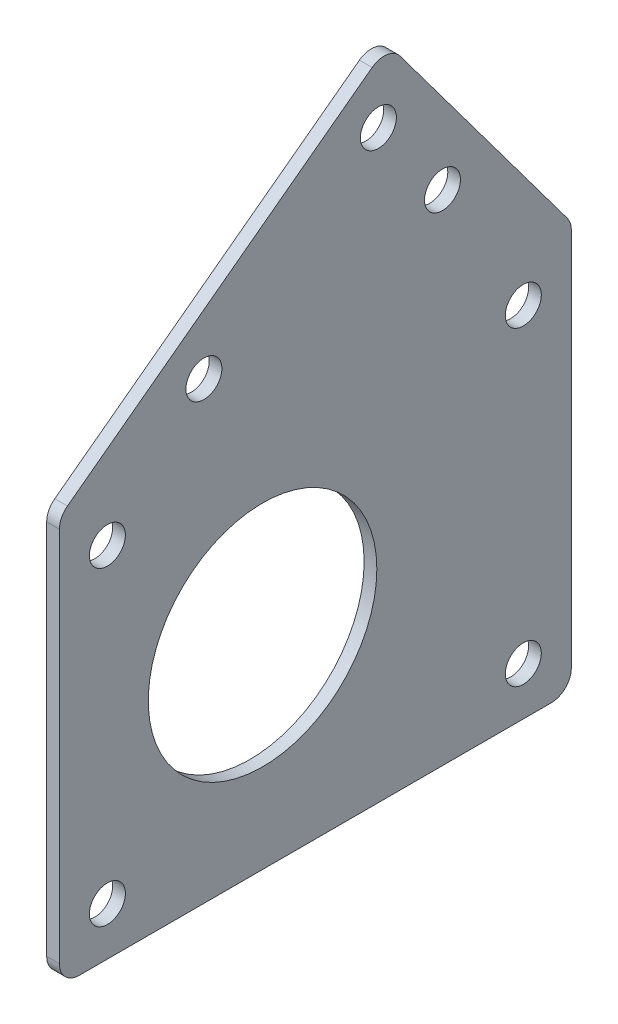
ISO-10303-21;
HEADER;
FILE_DESCRIPTION(('STEP AP214'),'2;1');
FILE_NAME('part.step','',(''),(''),'','','');
FILE_SCHEMA(('AUTOMOTIVE_DESIGN { 1 0 10303 214 1 1 1 1 }'));
ENDSEC;
DATA;
#1=APPLICATION_CONTEXT('core data for automotive mechanical design processes');
#2=APPLICATION_PROTOCOL_DEFINITION('international standard','automotive_design',2000,#1);
#3=PRODUCT_CONTEXT('',#1,'mechanical');
#4=PRODUCT('Part','Part','',(#3));
#5=PRODUCT_RELATED_PRODUCT_CATEGORY('part','',(#4));
#6=PRODUCT_DEFINITION_FORMATION('','',#4);
#7=PRODUCT_DEFINITION_CONTEXT('part definition',#1,'design');
#8=PRODUCT_DEFINITION('design','',#6,#7);
#9=PRODUCT_DEFINITION_SHAPE('','',#8);
#10=(LENGTH_UNIT() NAMED_UNIT(*) SI_UNIT(.MILLI.,.METRE.));
#11=(NAMED_UNIT(*) PLANE_ANGLE_UNIT() SI_UNIT($,.RADIAN.));
#12=(NAMED_UNIT(*) SI_UNIT($,.STERADIAN.) SOLID_ANGLE_UNIT());
#13=UNCERTAINTY_MEASURE_WITH_UNIT(LENGTH_MEASURE(1.E-05),#10,'distance_accuracy_value','');
#14=(GEOMETRIC_REPRESENTATION_CONTEXT(3) GLOBAL_UNCERTAINTY_ASSIGNED_CONTEXT((#13)) GLOBAL_UNIT_ASSIGNED_CONTEXT((#10,
#11,#12)) REPRESENTATION_CONTEXT('',''));
#15=CARTESIAN_POINT('',(0.,0.,0.));
#16=DIRECTION('',(0.,0.,1.));
#17=DIRECTION('',(1.,0.,0.));
#18=AXIS2_PLACEMENT_3D('',#15,#16,#17);
#19=CARTESIAN_POINT('',(103.1875,24.5697881383849,-36.1));
#20=DIRECTION('',(-1.,0.,0.));
#21=DIRECTION('',(0.,0.,1.));
#22=AXIS2_PLACEMENT_3D('',#19,#20,#21);
#23=CYLINDRICAL_SURFACE('',#22,2.5);
#24=CARTESIAN_POINT('',(101.6,24.5697881383849,-36.1));
#25=DIRECTION('',(1.,0.,0.));
#26=DIRECTION('',(0.,0.,-1.));
#27=AXIS2_PLACEMENT_3D('',#24,#25,#26);
#28=CIRCLE('',#27,2.5);
#29=CARTESIAN_POINT('',(101.6,26.0652877493296,-38.1033673935812));
#30=VERTEX_POINT('',#29);
#31=CARTESIAN_POINT('',(101.6,24.5697881383849,-38.6));
#32=VERTEX_POINT('',#31);
#33=EDGE_CURVE('E171',#30,#32,#28,.F.);
#34=ORIENTED_EDGE('',*,*,#33,.F.);
#35=DIRECTION('',(-1.,0.,0.));
#36=VECTOR('',#35,1.);
#37=CARTESIAN_POINT('',(103.1875,26.0652877493296,-38.1033673935812));
#38=LINE('',#37,#36);
#39=CARTESIAN_POINT('',(103.1875,26.0652877493296,-38.1033673935812));
#40=VERTEX_POINT('',#39);
#41=EDGE_CURVE('E11',#40,#30,#38,.T.);
#42=ORIENTED_EDGE('',*,*,#41,.F.);
#43=CARTESIAN_POINT('',(103.1875,24.5697881383849,-36.1));
#44=DIRECTION('',(1.,0.,0.));
#45=DIRECTION('',(0.,0.,-1.));
#46=AXIS2_PLACEMENT_3D('',#43,#44,#45);
#47=CIRCLE('',#46,2.5);
#48=CARTESIAN_POINT('',(103.1875,24.5697881383849,-38.6));
#49=VERTEX_POINT('',#48);
#50=EDGE_CURVE('E218',#40,#49,#47,.F.);
#51=ORIENTED_EDGE('',*,*,#50,.T.);
#52=DIRECTION('',(-1.,0.,0.));
#53=VECTOR('',#52,1.);
#54=CARTESIAN_POINT('',(103.1875,24.5697881383849,-38.6));
#55=LINE('',#54,#53);
#56=EDGE_CURVE('E57',#49,#32,#55,.T.);
#57=ORIENTED_EDGE('',*,*,#56,.T.);
#58=EDGE_LOOP('',(#34,#42,#51,#57));
#59=FACE_BOUND('',#58,.T.);
#60=ADVANCED_FACE('F41',(#59),#23,.T.);
#61=CARTESIAN_POINT('',(103.1875,27.5927267006994,-36.9631450036021));
#62=DIRECTION('',(0.,0.598199844377869,-0.80134695743248));
#63=DIRECTION('',(0.,0.80134695743248,0.598199844377869));
#64=AXIS2_PLACEMENT_3D('',#61,#62,#63);
#65=PLANE('',#64);
#66=DIRECTION('',(0.,-0.80134695743248,-0.598199844377869));
#67=VECTOR('',#66,1.);
#68=CARTESIAN_POINT('',(101.6,27.5927267006994,-36.9631450036021));
#69=LINE('',#68,#67);
#70=CARTESIAN_POINT('',(101.6,54.0760326210612,-17.1935441668675));
#71=VERTEX_POINT('',#70);
#72=EDGE_CURVE('E173',#71,#30,#69,.T.);
#73=ORIENTED_EDGE('',*,*,#72,.F.);
#74=DIRECTION('',(-1.,0.,0.));
#75=VECTOR('',#74,1.);
#76=CARTESIAN_POINT('',(103.1875,54.0760326210612,-17.1935441668675));
#77=LINE('',#76,#75);
#78=CARTESIAN_POINT('',(103.1875,54.0760326210612,-17.1935441668675));
#79=VERTEX_POINT('',#78);
#80=EDGE_CURVE('E49',#79,#71,#77,.T.);
#81=ORIENTED_EDGE('',*,*,#80,.F.);
#82=DIRECTION('',(0.,-0.80134695743248,-0.598199844377869));
#83=VECTOR('',#82,1.);
#84=CARTESIAN_POINT('',(103.1875,27.5927267006994,-36.9631450036021));
#85=LINE('',#84,#83);
#86=EDGE_CURVE('E254',#79,#40,#85,.T.);
#87=ORIENTED_EDGE('',*,*,#86,.T.);
#88=ORIENTED_EDGE('',*,*,#41,.T.);
#89=EDGE_LOOP('',(#73,#81,#87,#88));
#90=FACE_BOUND('',#89,.T.);
#91=ADVANCED_FACE('F241',(#90),#65,.T.);
#92=CARTESIAN_POINT('',(103.1875,52.5805330101165,-15.1901767732863));
#93=DIRECTION('',(-1.,0.,0.));
#94=DIRECTION('',(0.,0.,1.));
#95=AXIS2_PLACEMENT_3D('',#92,#93,#94);
#96=CYLINDRICAL_SURFACE('',#95,2.5);
#97=CARTESIAN_POINT('',(101.6,52.5805330101165,-15.1901767732863));
#98=DIRECTION('',(1.,0.,0.));
#99=DIRECTION('',(0.,0.,-1.));
#100=AXIS2_PLACEMENT_3D('',#97,#98,#99);
#101=CIRCLE('',#100,2.5);
#102=CARTESIAN_POINT('',(101.6,54.5839004036977,-13.6946771623416));
#103=VERTEX_POINT('',#102);
#104=EDGE_CURVE('E176',#103,#71,#101,.F.);
#105=ORIENTED_EDGE('',*,*,#104,.F.);
#106=DIRECTION('',(-1.,0.,0.));
#107=VECTOR('',#106,1.);
#108=CARTESIAN_POINT('',(103.1875,54.5839004036977,-13.6946771623416));
#109=LINE('',#108,#107);
#110=CARTESIAN_POINT('',(103.1875,54.5839004036977,-13.6946771623416));
#111=VERTEX_POINT('',#110);
#112=EDGE_CURVE('E230',#111,#103,#109,.T.);
#113=ORIENTED_EDGE('',*,*,#112,.F.);
#114=CARTESIAN_POINT('',(103.1875,52.5805330101165,-15.1901767732863));
#115=DIRECTION('',(1.,0.,0.));
#116=DIRECTION('',(0.,0.,-1.));
#117=AXIS2_PLACEMENT_3D('',#114,#115,#116);
#118=CIRCLE('',#117,2.5);
#119=EDGE_CURVE('E237',#111,#79,#118,.F.);
#120=ORIENTED_EDGE('',*,*,#119,.T.);
#121=ORIENTED_EDGE('',*,*,#80,.T.);
#122=EDGE_LOOP('',(#105,#113,#120,#121));
#123=FACE_BOUND('',#122,.T.);
#124=ADVANCED_FACE('F235',(#123),#96,.T.);
#125=CARTESIAN_POINT('',(103.1875,28.4866733139431,21.2651004476793));
#126=DIRECTION('',(0.,0.801346957432481,0.598199844377868));
#127=DIRECTION('',(0.,-0.598199844377868,0.801346957432481));
#128=AXIS2_PLACEMENT_3D('',#125,#126,#127);
#129=PLANE('',#128);
#130=DIRECTION('',(0.,0.598199844377868,-0.801346957432481));
#131=VECTOR('',#130,1.);
#132=CARTESIAN_POINT('',(101.6,28.4866733139431,21.2651004476793));
#133=LINE('',#132,#131);
#134=CARTESIAN_POINT('',(101.6,26.1498524463557,24.3954996109447));
#135=VERTEX_POINT('',#134);
#136=EDGE_CURVE('E179',#135,#103,#133,.T.);
#137=ORIENTED_EDGE('',*,*,#136,.F.);
#138=DIRECTION('',(-1.,0.,0.));
#139=VECTOR('',#138,1.);
#140=CARTESIAN_POINT('',(103.1875,26.1498524463557,24.3954996109447));
#141=LINE('',#140,#139);
#142=CARTESIAN_POINT('',(103.1875,26.1498524463557,24.3954996109447));
#143=VERTEX_POINT('',#142);
#144=EDGE_CURVE('E228',#143,#135,#141,.T.);
#145=ORIENTED_EDGE('',*,*,#144,.F.);
#146=DIRECTION('',(0.,0.598199844377868,-0.801346957432481));
#147=VECTOR('',#146,1.);
#148=CARTESIAN_POINT('',(103.1875,28.4866733139431,21.2651004476793));
#149=LINE('',#148,#147);
#150=EDGE_CURVE('E253',#143,#111,#149,.T.);
#151=ORIENTED_EDGE('',*,*,#150,.T.);
#152=ORIENTED_EDGE('',*,*,#112,.T.);
#153=EDGE_LOOP('',(#137,#145,#151,#152));
#154=FACE_BOUND('',#153,.T.);
#155=ADVANCED_FACE('F249',(#154),#129,.T.);
#156=CARTESIAN_POINT('',(103.1875,24.1464850527745,22.9));
#157=DIRECTION('',(-1.,0.,0.));
#158=DIRECTION('',(0.,0.,1.));
#159=AXIS2_PLACEMENT_3D('',#156,#157,#158);
#160=CYLINDRICAL_SURFACE('',#159,2.5);
#161=CARTESIAN_POINT('',(101.6,24.1464850527745,22.9));
#162=DIRECTION('',(1.,0.,0.));
#163=DIRECTION('',(0.,0.,-1.));
#164=AXIS2_PLACEMENT_3D('',#161,#162,#163);
#165=CIRCLE('',#164,2.5);
#166=CARTESIAN_POINT('',(101.6,24.1464850527744,25.4));
#167=VERTEX_POINT('',#166);
#168=EDGE_CURVE('E182',#135,#167,#165,.T.);
#169=ORIENTED_EDGE('',*,*,#168,.T.);
#170=DIRECTION('',(-1.,0.,0.));
#171=VECTOR('',#170,1.);
#172=CARTESIAN_POINT('',(103.1875,24.1464850527744,25.4));
#173=LINE('',#172,#171);
#174=CARTESIAN_POINT('',(103.1875,24.1464850527744,25.4));
#175=VERTEX_POINT('',#174);
#176=EDGE_CURVE('E225',#175,#167,#173,.T.);
#177=ORIENTED_EDGE('',*,*,#176,.F.);
#178=CARTESIAN_POINT('',(103.1875,24.1464850527745,22.9));
#179=DIRECTION('',(1.,0.,0.));
#180=DIRECTION('',(0.,0.,-1.));
#181=AXIS2_PLACEMENT_3D('',#178,#179,#180);
#182=CIRCLE('',#181,2.5);
#183=EDGE_CURVE('E256',#143,#175,#182,.T.);
#184=ORIENTED_EDGE('',*,*,#183,.F.);
#185=ORIENTED_EDGE('',*,*,#144,.T.);
#186=EDGE_LOOP('',(#169,#177,#184,#185));
#187=FACE_BOUND('',#186,.T.);
#188=ADVANCED_FACE('F297',(#187),#160,.T.);
#189=CARTESIAN_POINT('',(103.1875,0.,25.4));
#190=DIRECTION('',(0.,0.,-1.));
#191=DIRECTION('',(0.,1.,0.));
#192=AXIS2_PLACEMENT_3D('',#189,#190,#191);
#193=PLANE('',#192);
#194=DIRECTION('',(0.,-1.,0.));
#195=VECTOR('',#194,1.);
#196=CARTESIAN_POINT('',(101.6,0.,25.4));
#197=LINE('',#196,#195);
#198=CARTESIAN_POINT('',(101.6,-22.9,25.4));
#199=VERTEX_POINT('',#198);
#200=EDGE_CURVE('E184',#167,#199,#197,.T.);
#201=ORIENTED_EDGE('',*,*,#200,.T.);
#202=DIRECTION('',(-1.,0.,0.));
#203=VECTOR('',#202,1.);
#204=CARTESIAN_POINT('',(103.1875,-22.9,25.4));
#205=LINE('',#204,#203);
#206=CARTESIAN_POINT('',(103.1875,-22.9,25.4));
#207=VERTEX_POINT('',#206);
#208=EDGE_CURVE('E222',#207,#199,#205,.T.);
#209=ORIENTED_EDGE('',*,*,#208,.F.);
#210=DIRECTION('',(0.,-1.,0.));
#211=VECTOR('',#210,1.);
#212=CARTESIAN_POINT('',(103.1875,0.,25.4));
#213=LINE('',#212,#211);
#214=EDGE_CURVE('E262',#175,#207,#213,.T.);
#215=ORIENTED_EDGE('',*,*,#214,.F.);
#216=ORIENTED_EDGE('',*,*,#176,.T.);
#217=EDGE_LOOP('',(#201,#209,#215,#216));
#218=FACE_BOUND('',#217,.T.);
#219=ADVANCED_FACE('F267',(#218),#193,.F.);
#220=CARTESIAN_POINT('',(103.1875,-22.9,22.9));
#221=DIRECTION('',(-1.,0.,0.));
#222=DIRECTION('',(0.,0.,1.));
#223=AXIS2_PLACEMENT_3D('',#220,#221,#222);
#224=CYLINDRICAL_SURFACE('',#223,2.5);
#225=CARTESIAN_POINT('',(101.6,-22.9,22.9));
#226=DIRECTION('',(1.,0.,0.));
#227=DIRECTION('',(0.,0.,-1.));
#228=AXIS2_PLACEMENT_3D('',#225,#226,#227);
#229=CIRCLE('',#228,2.5);
#230=CARTESIAN_POINT('',(101.6,-25.4,22.9));
#231=VERTEX_POINT('',#230);
#232=EDGE_CURVE('E186',#199,#231,#229,.T.);
#233=ORIENTED_EDGE('',*,*,#232,.T.);
#234=DIRECTION('',(-1.,0.,0.));
#235=VECTOR('',#234,1.);
#236=CARTESIAN_POINT('',(103.1875,-25.4,22.9));
#237=LINE('',#236,#235);
#238=CARTESIAN_POINT('',(103.1875,-25.4,22.9));
#239=VERTEX_POINT('',#238);
#240=EDGE_CURVE('E139',#239,#231,#237,.T.);
#241=ORIENTED_EDGE('',*,*,#240,.F.);
#242=CARTESIAN_POINT('',(103.1875,-22.9,22.9));
#243=DIRECTION('',(1.,0.,0.));
#244=DIRECTION('',(0.,0.,-1.));
#245=AXIS2_PLACEMENT_3D('',#242,#243,#244);
#246=CIRCLE('',#245,2.5);
#247=EDGE_CURVE('E127',#207,#239,#246,.T.);
#248=ORIENTED_EDGE('',*,*,#247,.F.);
#249=ORIENTED_EDGE('',*,*,#208,.T.);
#250=EDGE_LOOP('',(#233,#241,#248,#249));
#251=FACE_BOUND('',#250,.T.);
#252=ADVANCED_FACE('F270',(#251),#224,.T.);
#253=CARTESIAN_POINT('',(103.1875,-25.4,0.));
#254=DIRECTION('',(0.,1.,0.));
#255=DIRECTION('',(0.,0.,1.));
#256=AXIS2_PLACEMENT_3D('',#253,#254,#255);
#257=PLANE('',#256);
#258=DIRECTION('',(0.,0.,-1.));
#259=VECTOR('',#258,1.);
#260=CARTESIAN_POINT('',(101.6,-25.4,0.));
#261=LINE('',#260,#259);
#262=CARTESIAN_POINT('',(101.6,-25.4,-36.1));
#263=VERTEX_POINT('',#262);
#264=EDGE_CURVE('E136',#231,#263,#261,.T.);
#265=ORIENTED_EDGE('',*,*,#264,.T.);
#266=DIRECTION('',(-1.,0.,0.));
#267=VECTOR('',#266,1.);
#268=CARTESIAN_POINT('',(103.1875,-25.4,-36.1));
#269=LINE('',#268,#267);
#270=CARTESIAN_POINT('',(103.1875,-25.4,-36.1));
#271=VERTEX_POINT('',#270);
#272=EDGE_CURVE('E133',#271,#263,#269,.T.);
#273=ORIENTED_EDGE('',*,*,#272,.F.);
#274=DIRECTION('',(0.,0.,-1.));
#275=VECTOR('',#274,1.);
#276=CARTESIAN_POINT('',(103.1875,-25.4,0.));
#277=LINE('',#276,#275);
#278=EDGE_CURVE('E119',#239,#271,#277,.T.);
#279=ORIENTED_EDGE('',*,*,#278,.F.);
#280=ORIENTED_EDGE('',*,*,#240,.T.);
#281=EDGE_LOOP('',(#265,#273,#279,#280));
#282=FACE_BOUND('',#281,.T.);
#283=ADVANCED_FACE('F134',(#282),#257,.F.);
#284=CARTESIAN_POINT('',(103.1875,-22.9,-36.1));
#285=DIRECTION('',(-1.,0.,0.));
#286=DIRECTION('',(0.,0.,1.));
#287=AXIS2_PLACEMENT_3D('',#284,#285,#286);
#288=CYLINDRICAL_SURFACE('',#287,2.5);
#289=CARTESIAN_POINT('',(101.6,-22.9,-36.1));
#290=DIRECTION('',(1.,0.,0.));
#291=DIRECTION('',(0.,0.,-1.));
#292=AXIS2_PLACEMENT_3D('',#289,#290,#291);
#293=CIRCLE('',#292,2.5);
#294=CARTESIAN_POINT('',(101.6,-22.9,-38.6));
#295=VERTEX_POINT('',#294);
#296=EDGE_CURVE('E189',#263,#295,#293,.T.);
#297=ORIENTED_EDGE('',*,*,#296,.T.);
#298=DIRECTION('',(-1.,0.,0.));
#299=VECTOR('',#298,1.);
#300=CARTESIAN_POINT('',(103.1875,-22.9,-38.6));
#301=LINE('',#300,#299);
#302=CARTESIAN_POINT('',(103.1875,-22.9,-38.6));
#303=VERTEX_POINT('',#302);
#304=EDGE_CURVE('E89',#303,#295,#301,.T.);
#305=ORIENTED_EDGE('',*,*,#304,.F.);
#306=CARTESIAN_POINT('',(103.1875,-22.9,-36.1));
#307=DIRECTION('',(1.,0.,0.));
#308=DIRECTION('',(0.,0.,-1.));
#309=AXIS2_PLACEMENT_3D('',#306,#307,#308);
#310=CIRCLE('',#309,2.5);
#311=EDGE_CURVE('E125',#271,#303,#310,.T.);
#312=ORIENTED_EDGE('',*,*,#311,.F.);
#313=ORIENTED_EDGE('',*,*,#272,.T.);
#314=EDGE_LOOP('',(#297,#305,#312,#313));
#315=FACE_BOUND('',#314,.T.);
#316=ADVANCED_FACE('F141',(#315),#288,.T.);
#317=CARTESIAN_POINT('',(103.1875,36.9440699741851,-22.4950397922586));
#318=DIRECTION('',(-1.,0.,0.));
#319=DIRECTION('',(0.,0.,1.));
#320=AXIS2_PLACEMENT_3D('',#317,#318,#319);
#321=CYLINDRICAL_SURFACE('',#320,2.25);
#322=CARTESIAN_POINT('',(103.1875,36.9440699741851,-22.4950397922586));
#323=DIRECTION('',(1.,0.,0.));
#324=DIRECTION('',(0.,0.,-1.));
#325=AXIS2_PLACEMENT_3D('',#322,#323,#324);
#326=CIRCLE('',#325,2.25);
#327=CARTESIAN_POINT('',(103.1875,36.9440699741851,-24.7450397922586));
#328=VERTEX_POINT('',#327);
#329=EDGE_CURVE('E165',#328,#328,#326,.T.);
#330=ORIENTED_EDGE('',*,*,#329,.T.);
#331=EDGE_LOOP('',(#330));
#332=FACE_BOUND('',#331,.T.);
#333=CARTESIAN_POINT('',(101.6,36.9440699741851,-22.4950397922586));
#334=DIRECTION('',(1.,0.,0.));
#335=DIRECTION('',(0.,0.,-1.));
#336=AXIS2_PLACEMENT_3D('',#333,#334,#335);
#337=CIRCLE('',#336,2.25);
#338=CARTESIAN_POINT('',(101.6,36.9440699741851,-24.7450397922586));
#339=VERTEX_POINT('',#338);
#340=EDGE_CURVE('E212',#339,#339,#337,.T.);
#341=ORIENTED_EDGE('',*,*,#340,.F.);
#342=EDGE_LOOP('',(#341));
#343=FACE_BOUND('',#342,.T.);
#344=ADVANCED_FACE('F307',(#332,#343),#321,.F.);
#345=CARTESIAN_POINT('',(103.1875,31.4,7.33232270758054));
#346=DIRECTION('',(-1.,0.,0.));
#347=DIRECTION('',(0.,0.,1.));
#348=AXIS2_PLACEMENT_3D('',#345,#346,#347);
#349=CYLINDRICAL_SURFACE('',#348,2.25);
#350=CARTESIAN_POINT('',(103.1875,31.4,7.33232270758054));
#351=DIRECTION('',(1.,0.,0.));
#352=DIRECTION('',(0.,0.,-1.));
#353=AXIS2_PLACEMENT_3D('',#350,#351,#352);
#354=CIRCLE('',#353,2.25);
#355=CARTESIAN_POINT('',(103.1875,31.4,5.08232270758054));
#356=VERTEX_POINT('',#355);
#357=EDGE_CURVE('E162',#356,#356,#354,.T.);
#358=ORIENTED_EDGE('',*,*,#357,.T.);
#359=EDGE_LOOP('',(#358));
#360=FACE_BOUND('',#359,.T.);
#361=CARTESIAN_POINT('',(101.6,31.4,7.33232270758054));
#362=DIRECTION('',(1.,0.,0.));
#363=DIRECTION('',(0.,0.,-1.));
#364=AXIS2_PLACEMENT_3D('',#361,#362,#363);
#365=CIRCLE('',#364,2.25);
#366=CARTESIAN_POINT('',(101.6,31.4,5.08232270758054));
#367=VERTEX_POINT('',#366);
#368=EDGE_CURVE('E209',#367,#367,#365,.T.);
#369=ORIENTED_EDGE('',*,*,#368,.F.);
#370=EDGE_LOOP('',(#369));
#371=FACE_BOUND('',#370,.T.);
#372=ADVANCED_FACE('F311',(#360,#371),#349,.F.);
#373=CARTESIAN_POINT('',(103.1875,-19.4,-32.6));
#374=DIRECTION('',(-1.,0.,0.));
#375=DIRECTION('',(0.,0.,1.));
#376=AXIS2_PLACEMENT_3D('',#373,#374,#375);
#377=CYLINDRICAL_SURFACE('',#376,2.25);
#378=CARTESIAN_POINT('',(103.1875,-19.4,-32.6));
#379=DIRECTION('',(1.,0.,0.));
#380=DIRECTION('',(0.,0.,-1.));
#381=AXIS2_PLACEMENT_3D('',#378,#379,#380);
#382=CIRCLE('',#381,2.25);
#383=CARTESIAN_POINT('',(103.1875,-19.4,-34.85));
#384=VERTEX_POINT('',#383);
#385=EDGE_CURVE('E159',#384,#384,#382,.T.);
#386=ORIENTED_EDGE('',*,*,#385,.T.);
#387=EDGE_LOOP('',(#386));
#388=FACE_BOUND('',#387,.T.);
#389=CARTESIAN_POINT('',(101.6,-19.4,-32.6));
#390=DIRECTION('',(1.,0.,0.));
#391=DIRECTION('',(0.,0.,-1.));
#392=AXIS2_PLACEMENT_3D('',#389,#390,#391);
#393=CIRCLE('',#392,2.25);
#394=CARTESIAN_POINT('',(101.6,-19.4,-34.85));
#395=VERTEX_POINT('',#394);
#396=EDGE_CURVE('E206',#395,#395,#393,.T.);
#397=ORIENTED_EDGE('',*,*,#396,.F.);
#398=EDGE_LOOP('',(#397));
#399=FACE_BOUND('',#398,.T.);
#400=ADVANCED_FACE('F317',(#388,#399),#377,.F.);
#401=CARTESIAN_POINT('',(103.1875,19.4,-32.6));
#402=DIRECTION('',(-1.,0.,0.));
#403=DIRECTION('',(0.,0.,1.));
#404=AXIS2_PLACEMENT_3D('',#401,#402,#403);
#405=CYLINDRICAL_SURFACE('',#404,2.25);
#406=CARTESIAN_POINT('',(103.1875,19.4,-32.6));
#407=DIRECTION('',(1.,0.,0.));
#408=DIRECTION('',(0.,0.,-1.));
#409=AXIS2_PLACEMENT_3D('',#406,#407,#408);
#410=CIRCLE('',#409,2.25);
#411=CARTESIAN_POINT('',(103.1875,19.4,-34.85));
#412=VERTEX_POINT('',#411);
#413=EDGE_CURVE('E156',#412,#412,#410,.T.);
#414=ORIENTED_EDGE('',*,*,#413,.T.);
#415=EDGE_LOOP('',(#414));
#416=FACE_BOUND('',#415,.T.);
#417=CARTESIAN_POINT('',(101.6,19.4,-32.6));
#418=DIRECTION('',(1.,0.,0.));
#419=DIRECTION('',(0.,0.,-1.));
#420=AXIS2_PLACEMENT_3D('',#417,#418,#419);
#421=CIRCLE('',#420,2.25);
#422=CARTESIAN_POINT('',(101.6,19.4,-34.85));
#423=VERTEX_POINT('',#422);
#424=EDGE_CURVE('E203',#423,#423,#421,.T.);
#425=ORIENTED_EDGE('',*,*,#424,.F.);
#426=EDGE_LOOP('',(#425));
#427=FACE_BOUND('',#426,.T.);
#428=ADVANCED_FACE('F325',(#416,#427),#405,.F.);
#429=CARTESIAN_POINT('',(103.1875,-19.4,19.4));
#430=DIRECTION('',(-1.,0.,0.));
#431=DIRECTION('',(0.,0.,1.));
#432=AXIS2_PLACEMENT_3D('',#429,#430,#431);
#433=CYLINDRICAL_SURFACE('',#432,2.25);
#434=CARTESIAN_POINT('',(103.1875,-19.4,19.4));
#435=DIRECTION('',(1.,0.,0.));
#436=DIRECTION('',(0.,0.,-1.));
#437=AXIS2_PLACEMENT_3D('',#434,#435,#436);
#438=CIRCLE('',#437,2.25);
#439=CARTESIAN_POINT('',(103.1875,-19.4,17.15));
#440=VERTEX_POINT('',#439);
#441=EDGE_CURVE('E153',#440,#440,#438,.T.);
#442=ORIENTED_EDGE('',*,*,#441,.T.);
#443=EDGE_LOOP('',(#442));
#444=FACE_BOUND('',#443,.T.);
#445=CARTESIAN_POINT('',(101.6,-19.4,19.4));
#446=DIRECTION('',(1.,0.,0.));
#447=DIRECTION('',(0.,0.,-1.));
#448=AXIS2_PLACEMENT_3D('',#445,#446,#447);
#449=CIRCLE('',#448,2.25);
#450=CARTESIAN_POINT('',(101.6,-19.4,17.15));
#451=VERTEX_POINT('',#450);
#452=EDGE_CURVE('E200',#451,#451,#449,.T.);
#453=ORIENTED_EDGE('',*,*,#452,.F.);
#454=EDGE_LOOP('',(#453));
#455=FACE_BOUND('',#454,.T.);
#456=ADVANCED_FACE('F329',(#444,#455),#433,.F.);
#457=CARTESIAN_POINT('',(103.1875,19.4,19.4));
#458=DIRECTION('',(-1.,0.,0.));
#459=DIRECTION('',(0.,0.,1.));
#460=AXIS2_PLACEMENT_3D('',#457,#458,#459);
#461=CYLINDRICAL_SURFACE('',#460,2.25);
#462=CARTESIAN_POINT('',(103.1875,19.4,19.4));
#463=DIRECTION('',(1.,0.,0.));
#464=DIRECTION('',(0.,0.,-1.));
#465=AXIS2_PLACEMENT_3D('',#462,#463,#464);
#466=CIRCLE('',#465,2.25);
#467=CARTESIAN_POINT('',(103.1875,19.4,17.15));
#468=VERTEX_POINT('',#467);
#469=EDGE_CURVE('E150',#468,#468,#466,.T.);
#470=ORIENTED_EDGE('',*,*,#469,.T.);
#471=EDGE_LOOP('',(#470));
#472=FACE_BOUND('',#471,.T.);
#473=CARTESIAN_POINT('',(101.6,19.4,19.4));
#474=DIRECTION('',(1.,0.,0.));
#475=DIRECTION('',(0.,0.,-1.));
#476=AXIS2_PLACEMENT_3D('',#473,#474,#475);
#477=CIRCLE('',#476,2.25);
#478=CARTESIAN_POINT('',(101.6,19.4,17.15));
#479=VERTEX_POINT('',#478);
#480=EDGE_CURVE('E197',#479,#479,#477,.T.);
#481=ORIENTED_EDGE('',*,*,#480,.F.);
#482=EDGE_LOOP('',(#481));
#483=FACE_BOUND('',#482,.T.);
#484=ADVANCED_FACE('F282',(#472,#483),#461,.F.);
#485=CARTESIAN_POINT('',(103.1875,0.,0.));
#486=DIRECTION('',(-1.,0.,0.));
#487=DIRECTION('',(0.,0.,1.));
#488=AXIS2_PLACEMENT_3D('',#485,#486,#487);
#489=CYLINDRICAL_SURFACE('',#488,14.2875);
#490=CARTESIAN_POINT('',(103.1875,0.,0.));
#491=DIRECTION('',(1.,0.,0.));
#492=DIRECTION('',(0.,0.,-1.));
#493=AXIS2_PLACEMENT_3D('',#490,#491,#492);
#494=CIRCLE('',#493,14.2875);
#495=CARTESIAN_POINT('',(103.1875,0.,-14.2875));
#496=VERTEX_POINT('',#495);
#497=EDGE_CURVE('E144',#496,#496,#494,.T.);
#498=ORIENTED_EDGE('',*,*,#497,.T.);
#499=EDGE_LOOP('',(#498));
#500=FACE_BOUND('',#499,.T.);
#501=CARTESIAN_POINT('',(101.6,0.,0.));
#502=DIRECTION('',(1.,0.,0.));
#503=DIRECTION('',(0.,0.,-1.));
#504=AXIS2_PLACEMENT_3D('',#501,#502,#503);
#505=CIRCLE('',#504,14.2875);
#506=CARTESIAN_POINT('',(101.6,0.,-14.2875));
#507=VERTEX_POINT('',#506);
#508=EDGE_CURVE('E194',#507,#507,#505,.T.);
#509=ORIENTED_EDGE('',*,*,#508,.F.);
#510=EDGE_LOOP('',(#509));
#511=FACE_BOUND('',#510,.T.);
#512=ADVANCED_FACE('F274',(#500,#511),#489,.F.);
#513=CARTESIAN_POINT('',(103.1875,0.,-38.6));
#514=DIRECTION('',(0.,0.,-1.));
#515=DIRECTION('',(0.,1.,0.));
#516=AXIS2_PLACEMENT_3D('',#513,#514,#515);
#517=PLANE('',#516);
#518=DIRECTION('',(0.,-1.,0.));
#519=VECTOR('',#518,1.);
#520=CARTESIAN_POINT('',(101.6,0.,-38.6));
#521=LINE('',#520,#519);
#522=EDGE_CURVE('E191',#32,#295,#521,.T.);
#523=ORIENTED_EDGE('',*,*,#522,.F.);
#524=ORIENTED_EDGE('',*,*,#56,.F.);
#525=DIRECTION('',(0.,-1.,0.));
#526=VECTOR('',#525,1.);
#527=CARTESIAN_POINT('',(103.1875,0.,-38.6));
#528=LINE('',#527,#526);
#529=EDGE_CURVE('E142',#49,#303,#528,.T.);
#530=ORIENTED_EDGE('',*,*,#529,.T.);
#531=ORIENTED_EDGE('',*,*,#304,.T.);
#532=EDGE_LOOP('',(#523,#524,#530,#531));
#533=FACE_BOUND('',#532,.T.);
#534=ADVANCED_FACE('F271',(#533),#517,.T.);
#535=CARTESIAN_POINT('',(103.1875,47.6821192037804,-14.4791618775951));
#536=DIRECTION('',(-1.,0.,0.));
#537=DIRECTION('',(0.,0.,1.));
#538=AXIS2_PLACEMENT_3D('',#535,#536,#537);
#539=CYLINDRICAL_SURFACE('',#538,2.25);
#540=CARTESIAN_POINT('',(103.1875,47.6821192037804,-14.4791618775951));
#541=DIRECTION('',(1.,0.,0.));
#542=DIRECTION('',(0.,0.,-1.));
#543=AXIS2_PLACEMENT_3D('',#540,#541,#542);
#544=CIRCLE('',#543,2.25);
#545=CARTESIAN_POINT('',(103.1875,47.6821192037804,-16.7291618775951));
#546=VERTEX_POINT('',#545);
#547=EDGE_CURVE('E168',#546,#546,#544,.T.);
#548=ORIENTED_EDGE('',*,*,#547,.T.);
#549=EDGE_LOOP('',(#548));
#550=FACE_BOUND('',#549,.T.);
#551=CARTESIAN_POINT('',(101.6,47.6821192037804,-14.4791618775951));
#552=DIRECTION('',(1.,0.,0.));
#553=DIRECTION('',(0.,0.,-1.));
#554=AXIS2_PLACEMENT_3D('',#551,#552,#553);
#555=CIRCLE('',#554,2.25);
#556=CARTESIAN_POINT('',(101.6,47.6821192037804,-16.7291618775951));
#557=VERTEX_POINT('',#556);
#558=EDGE_CURVE('E215',#557,#557,#555,.T.);
#559=ORIENTED_EDGE('',*,*,#558,.F.);
#560=EDGE_LOOP('',(#559));
#561=FACE_BOUND('',#560,.T.);
#562=ADVANCED_FACE('F273',(#550,#561),#539,.F.);
#563=CARTESIAN_POINT('',(103.1875,0.,0.));
#564=DIRECTION('',(1.,0.,0.));
#565=DIRECTION('',(0.,0.,-1.));
#566=AXIS2_PLACEMENT_3D('',#563,#564,#565);
#567=PLANE('',#566);
#568=ORIENTED_EDGE('',*,*,#50,.F.);
#569=ORIENTED_EDGE('',*,*,#86,.F.);
#570=ORIENTED_EDGE('',*,*,#119,.F.);
#571=ORIENTED_EDGE('',*,*,#150,.F.);
#572=ORIENTED_EDGE('',*,*,#183,.T.);
#573=ORIENTED_EDGE('',*,*,#214,.T.);
#574=ORIENTED_EDGE('',*,*,#247,.T.);
#575=ORIENTED_EDGE('',*,*,#278,.T.);
#576=ORIENTED_EDGE('',*,*,#311,.T.);
#577=ORIENTED_EDGE('',*,*,#529,.F.);
#578=EDGE_LOOP('',(#568,#569,#570,#571,#572,#573,#574,#575,#576,#577));
#579=FACE_BOUND('',#578,.T.);
#580=ORIENTED_EDGE('',*,*,#497,.F.);
#581=EDGE_LOOP('',(#580));
#582=FACE_BOUND('',#581,.T.);
#583=ORIENTED_EDGE('',*,*,#469,.F.);
#584=EDGE_LOOP('',(#583));
#585=FACE_BOUND('',#584,.T.);
#586=ORIENTED_EDGE('',*,*,#441,.F.);
#587=EDGE_LOOP('',(#586));
#588=FACE_BOUND('',#587,.T.);
#589=ORIENTED_EDGE('',*,*,#413,.F.);
#590=EDGE_LOOP('',(#589));
#591=FACE_BOUND('',#590,.T.);
#592=ORIENTED_EDGE('',*,*,#385,.F.);
#593=EDGE_LOOP('',(#592));
#594=FACE_BOUND('',#593,.T.);
#595=ORIENTED_EDGE('',*,*,#357,.F.);
#596=EDGE_LOOP('',(#595));
#597=FACE_BOUND('',#596,.T.);
#598=ORIENTED_EDGE('',*,*,#329,.F.);
#599=EDGE_LOOP('',(#598));
#600=FACE_BOUND('',#599,.T.);
#601=ORIENTED_EDGE('',*,*,#547,.F.);
#602=EDGE_LOOP('',(#601));
#603=FACE_BOUND('',#602,.T.);
#604=ADVANCED_FACE('F121',(#579,#582,#585,#588,#591,#594,#597,#600,#603),#567,.T.);
#605=CARTESIAN_POINT('',(101.6,0.,0.));
#606=DIRECTION('',(1.,0.,0.));
#607=DIRECTION('',(0.,0.,-1.));
#608=AXIS2_PLACEMENT_3D('',#605,#606,#607);
#609=PLANE('',#608);
#610=ORIENTED_EDGE('',*,*,#33,.T.);
#611=ORIENTED_EDGE('',*,*,#522,.T.);
#612=ORIENTED_EDGE('',*,*,#296,.F.);
#613=ORIENTED_EDGE('',*,*,#264,.F.);
#614=ORIENTED_EDGE('',*,*,#232,.F.);
#615=ORIENTED_EDGE('',*,*,#200,.F.);
#616=ORIENTED_EDGE('',*,*,#168,.F.);
#617=ORIENTED_EDGE('',*,*,#136,.T.);
#618=ORIENTED_EDGE('',*,*,#104,.T.);
#619=ORIENTED_EDGE('',*,*,#72,.T.);
#620=EDGE_LOOP('',(#610,#611,#612,#613,#614,#615,#616,#617,#618,#619));
#621=FACE_BOUND('',#620,.T.);
#622=ORIENTED_EDGE('',*,*,#508,.T.);
#623=EDGE_LOOP('',(#622));
#624=FACE_BOUND('',#623,.T.);
#625=ORIENTED_EDGE('',*,*,#480,.T.);
#626=EDGE_LOOP('',(#625));
#627=FACE_BOUND('',#626,.T.);
#628=ORIENTED_EDGE('',*,*,#452,.T.);
#629=EDGE_LOOP('',(#628));
#630=FACE_BOUND('',#629,.T.);
#631=ORIENTED_EDGE('',*,*,#424,.T.);
#632=EDGE_LOOP('',(#631));
#633=FACE_BOUND('',#632,.T.);
#634=ORIENTED_EDGE('',*,*,#396,.T.);
#635=EDGE_LOOP('',(#634));
#636=FACE_BOUND('',#635,.T.);
#637=ORIENTED_EDGE('',*,*,#368,.T.);
#638=EDGE_LOOP('',(#637));
#639=FACE_BOUND('',#638,.T.);
#640=ORIENTED_EDGE('',*,*,#340,.T.);
#641=EDGE_LOOP('',(#640));
#642=FACE_BOUND('',#641,.T.);
#643=ORIENTED_EDGE('',*,*,#558,.T.);
#644=EDGE_LOOP('',(#643));
#645=FACE_BOUND('',#644,.T.);
#646=ADVANCED_FACE('F243',(#621,#624,#627,#630,#633,#636,#639,#642,#645),#609,.F.);
#647=CLOSED_SHELL('',(#60,#91,#124,#155,#188,#219,#252,#283,#316,#344,#372,#400,#428,#456,#484,
#512,#534,#562,#604,#646));
#648=MANIFOLD_SOLID_BREP('B2',#647);
#649=ADVANCED_BREP_SHAPE_REPRESENTATION('',(#18,#648),#14);
#650=SHAPE_DEFINITION_REPRESENTATION(#9,#649);
ENDSEC;
END-ISO-10303-21;
